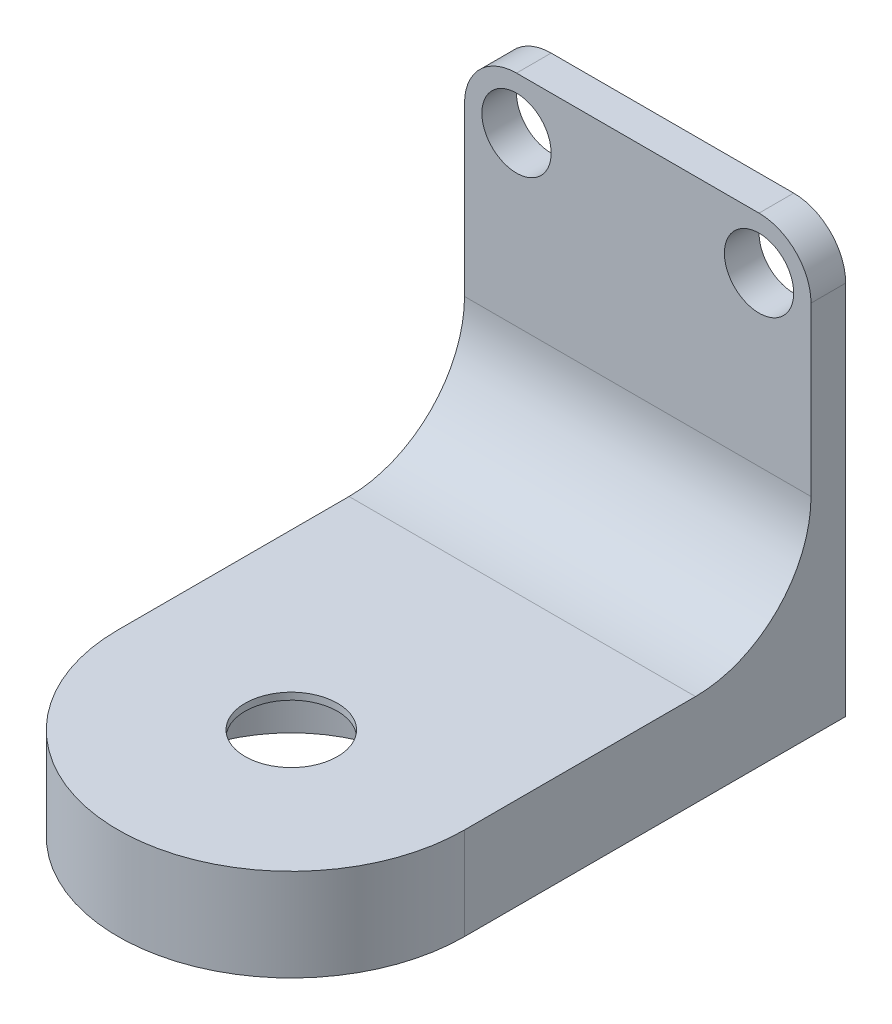
ISO-10303-21;
HEADER;
FILE_DESCRIPTION(('STEP AP214'),'2;1');
FILE_NAME('part.step','',(''),(''),'','','');
FILE_SCHEMA(('AUTOMOTIVE_DESIGN { 1 0 10303 214 1 1 1 1 }'));
ENDSEC;
DATA;
#1=APPLICATION_CONTEXT('core data for automotive mechanical design processes');
#2=APPLICATION_PROTOCOL_DEFINITION('international standard','automotive_design',2000,#1);
#3=PRODUCT_CONTEXT('',#1,'mechanical');
#4=PRODUCT('Part','Part','',(#3));
#5=PRODUCT_RELATED_PRODUCT_CATEGORY('part','',(#4));
#6=PRODUCT_DEFINITION_FORMATION('','',#4);
#7=PRODUCT_DEFINITION_CONTEXT('part definition',#1,'design');
#8=PRODUCT_DEFINITION('design','',#6,#7);
#9=PRODUCT_DEFINITION_SHAPE('','',#8);
#10=(LENGTH_UNIT() NAMED_UNIT(*) SI_UNIT(.MILLI.,.METRE.));
#11=(NAMED_UNIT(*) PLANE_ANGLE_UNIT() SI_UNIT($,.RADIAN.));
#12=(NAMED_UNIT(*) SI_UNIT($,.STERADIAN.) SOLID_ANGLE_UNIT());
#13=UNCERTAINTY_MEASURE_WITH_UNIT(LENGTH_MEASURE(1.E-05),#10,'distance_accuracy_value','');
#14=(GEOMETRIC_REPRESENTATION_CONTEXT(3) GLOBAL_UNCERTAINTY_ASSIGNED_CONTEXT((#13)) GLOBAL_UNIT_ASSIGNED_CONTEXT((#10,
#11,#12)) REPRESENTATION_CONTEXT('',''));
#15=CARTESIAN_POINT('',(0.,0.,0.));
#16=DIRECTION('',(0.,0.,1.));
#17=DIRECTION('',(1.,0.,0.));
#18=AXIS2_PLACEMENT_3D('',#15,#16,#17);
#19=CARTESIAN_POINT('',(0.,37.,0.));
#20=DIRECTION('',(0.,-1.,0.));
#21=DIRECTION('',(0.,0.,-1.));
#22=AXIS2_PLACEMENT_3D('',#19,#20,#21);
#23=CYLINDRICAL_SURFACE('',#22,4.);
#24=CARTESIAN_POINT('',(0.,8.,0.));
#25=DIRECTION('',(0.,1.,0.));
#26=DIRECTION('',(0.,0.,1.));
#27=AXIS2_PLACEMENT_3D('',#24,#25,#26);
#28=CIRCLE('',#27,4.);
#29=CARTESIAN_POINT('',(0.,8.,4.));
#30=VERTEX_POINT('',#29);
#31=EDGE_CURVE('E446',#30,#30,#28,.T.);
#32=ORIENTED_EDGE('',*,*,#31,.T.);
#33=EDGE_LOOP('',(#32));
#34=FACE_BOUND('',#33,.T.);
#35=CARTESIAN_POINT('',(0.,7.4,0.));
#36=DIRECTION('',(0.,-1.,0.));
#37=DIRECTION('',(0.,0.,-1.));
#38=AXIS2_PLACEMENT_3D('',#35,#36,#37);
#39=CIRCLE('',#38,4.);
#40=CARTESIAN_POINT('',(0.,7.4,-4.));
#41=VERTEX_POINT('',#40);
#42=EDGE_CURVE('E41',#41,#41,#39,.F.);
#43=ORIENTED_EDGE('',*,*,#42,.F.);
#44=EDGE_LOOP('',(#43));
#45=FACE_BOUND('',#44,.T.);
#46=ADVANCED_FACE('F37',(#34,#45),#23,.F.);
#47=CARTESIAN_POINT('',(0.,8.,0.));
#48=DIRECTION('',(0.,-1.,0.));
#49=DIRECTION('',(0.,0.,-1.));
#50=AXIS2_PLACEMENT_3D('',#47,#48,#49);
#51=CYLINDRICAL_SURFACE('',#50,11.);
#52=CARTESIAN_POINT('',(0.,0.,0.));
#53=DIRECTION('',(0.,1.,0.));
#54=DIRECTION('',(0.,0.,1.));
#55=AXIS2_PLACEMENT_3D('',#52,#53,#54);
#56=CIRCLE('',#55,11.);
#57=CARTESIAN_POINT('',(0.,0.,11.));
#58=VERTEX_POINT('',#57);
#59=EDGE_CURVE('E194',#58,#58,#56,.T.);
#60=ORIENTED_EDGE('',*,*,#59,.F.);
#61=EDGE_LOOP('',(#60));
#62=FACE_BOUND('',#61,.T.);
#63=CARTESIAN_POINT('',(0.,7.,0.));
#64=DIRECTION('',(0.,1.,0.));
#65=DIRECTION('',(0.,0.,1.));
#66=AXIS2_PLACEMENT_3D('',#63,#64,#65);
#67=CIRCLE('',#66,11.);
#68=CARTESIAN_POINT('',(0.,7.,11.));
#69=VERTEX_POINT('',#68);
#70=EDGE_CURVE('E142',#69,#69,#67,.T.);
#71=ORIENTED_EDGE('',*,*,#70,.T.);
#72=EDGE_LOOP('',(#71));
#73=FACE_BOUND('',#72,.T.);
#74=ADVANCED_FACE('F232',(#62,#73),#51,.F.);
#75=CARTESIAN_POINT('',(0.,8.,0.));
#76=DIRECTION('',(0.,1.,0.));
#77=DIRECTION('',(0.,0.,1.));
#78=AXIS2_PLACEMENT_3D('',#75,#76,#77);
#79=PLANE('',#78);
#80=ORIENTED_EDGE('',*,*,#31,.F.);
#81=EDGE_LOOP('',(#80));
#82=FACE_BOUND('',#81,.T.);
#83=DIRECTION('',(0.,0.,-1.));
#84=VECTOR('',#83,1.);
#85=CARTESIAN_POINT('',(15.,8.,-30.));
#86=LINE('',#85,#84);
#87=CARTESIAN_POINT('',(15.,8.,0.));
#88=VERTEX_POINT('',#87);
#89=CARTESIAN_POINT('',(15.,8.,-20.));
#90=VERTEX_POINT('',#89);
#91=EDGE_CURVE('E200',#88,#90,#86,.T.);
#92=ORIENTED_EDGE('',*,*,#91,.T.);
#93=DIRECTION('',(-1.,0.,0.));
#94=VECTOR('',#93,1.);
#95=CARTESIAN_POINT('',(0.,8.,-20.));
#96=LINE('',#95,#94);
#97=CARTESIAN_POINT('',(-15.,8.,-20.));
#98=VERTEX_POINT('',#97);
#99=EDGE_CURVE('E183',#90,#98,#96,.T.);
#100=ORIENTED_EDGE('',*,*,#99,.T.);
#101=DIRECTION('',(0.,0.,1.));
#102=VECTOR('',#101,1.);
#103=CARTESIAN_POINT('',(-15.,8.,0.));
#104=LINE('',#103,#102);
#105=CARTESIAN_POINT('',(-15.,8.,0.));
#106=VERTEX_POINT('',#105);
#107=EDGE_CURVE('E203',#98,#106,#104,.T.);
#108=ORIENTED_EDGE('',*,*,#107,.T.);
#109=CARTESIAN_POINT('',(0.,8.,0.));
#110=DIRECTION('',(0.,1.,0.));
#111=DIRECTION('',(0.,0.,1.));
#112=AXIS2_PLACEMENT_3D('',#109,#110,#111);
#113=CIRCLE('',#112,15.);
#114=EDGE_CURVE('E197',#106,#88,#113,.T.);
#115=ORIENTED_EDGE('',*,*,#114,.T.);
#116=EDGE_LOOP('',(#92,#100,#108,#115));
#117=FACE_BOUND('',#116,.T.);
#118=ADVANCED_FACE('F216',(#82,#117),#79,.T.);
#119=CARTESIAN_POINT('',(0.,0.,0.));
#120=DIRECTION('',(0.,1.,0.));
#121=DIRECTION('',(0.,0.,1.));
#122=AXIS2_PLACEMENT_3D('',#119,#120,#121);
#123=PLANE('',#122);
#124=CARTESIAN_POINT('',(0.,0.,0.));
#125=DIRECTION('',(0.,1.,0.));
#126=DIRECTION('',(0.,0.,1.));
#127=AXIS2_PLACEMENT_3D('',#124,#125,#126);
#128=CIRCLE('',#127,15.);
#129=CARTESIAN_POINT('',(-15.,0.,0.));
#130=VERTEX_POINT('',#129);
#131=CARTESIAN_POINT('',(15.,0.,0.));
#132=VERTEX_POINT('',#131);
#133=EDGE_CURVE('E120',#130,#132,#128,.T.);
#134=ORIENTED_EDGE('',*,*,#133,.F.);
#135=DIRECTION('',(0.,0.,1.));
#136=VECTOR('',#135,1.);
#137=CARTESIAN_POINT('',(-15.,0.,0.));
#138=LINE('',#137,#136);
#139=CARTESIAN_POINT('',(-15.,0.,-33.));
#140=VERTEX_POINT('',#139);
#141=EDGE_CURVE('E119',#140,#130,#138,.T.);
#142=ORIENTED_EDGE('',*,*,#141,.F.);
#143=DIRECTION('',(-1.,0.,0.));
#144=VECTOR('',#143,1.);
#145=CARTESIAN_POINT('',(0.,0.,-33.));
#146=LINE('',#145,#144);
#147=CARTESIAN_POINT('',(15.,0.,-33.));
#148=VERTEX_POINT('',#147);
#149=EDGE_CURVE('E123',#148,#140,#146,.T.);
#150=ORIENTED_EDGE('',*,*,#149,.F.);
#151=DIRECTION('',(0.,0.,-1.));
#152=VECTOR('',#151,1.);
#153=CARTESIAN_POINT('',(15.,0.,-30.));
#154=LINE('',#153,#152);
#155=EDGE_CURVE('E108',#132,#148,#154,.T.);
#156=ORIENTED_EDGE('',*,*,#155,.F.);
#157=EDGE_LOOP('',(#134,#142,#150,#156));
#158=FACE_BOUND('',#157,.T.);
#159=ORIENTED_EDGE('',*,*,#59,.T.);
#160=EDGE_LOOP('',(#159));
#161=FACE_BOUND('',#160,.T.);
#162=ADVANCED_FACE('F124',(#158,#161),#123,.F.);
#163=CARTESIAN_POINT('',(0.,8.,0.));
#164=DIRECTION('',(0.,-1.,0.));
#165=DIRECTION('',(0.,0.,-1.));
#166=AXIS2_PLACEMENT_3D('',#163,#164,#165);
#167=CYLINDRICAL_SURFACE('',#166,15.);
#168=ORIENTED_EDGE('',*,*,#133,.T.);
#169=DIRECTION('',(0.,-1.,0.));
#170=VECTOR('',#169,1.);
#171=CARTESIAN_POINT('',(15.,8.,0.));
#172=LINE('',#171,#170);
#173=EDGE_CURVE('E115',#88,#132,#172,.T.);
#174=ORIENTED_EDGE('',*,*,#173,.F.);
#175=ORIENTED_EDGE('',*,*,#114,.F.);
#176=DIRECTION('',(0.,-1.,0.));
#177=VECTOR('',#176,1.);
#178=CARTESIAN_POINT('',(-15.,8.,0.));
#179=LINE('',#178,#177);
#180=EDGE_CURVE('E205',#106,#130,#179,.T.);
#181=ORIENTED_EDGE('',*,*,#180,.T.);
#182=EDGE_LOOP('',(#168,#174,#175,#181));
#183=FACE_BOUND('',#182,.T.);
#184=ADVANCED_FACE('F223',(#183),#167,.T.);
#185=CARTESIAN_POINT('',(15.,8.,-30.));
#186=DIRECTION('',(-1.,0.,0.));
#187=DIRECTION('',(0.,0.,1.));
#188=AXIS2_PLACEMENT_3D('',#185,#186,#187);
#189=PLANE('',#188);
#190=ORIENTED_EDGE('',*,*,#155,.T.);
#191=DIRECTION('',(0.,-1.,0.));
#192=VECTOR('',#191,1.);
#193=CARTESIAN_POINT('',(15.,0.,-33.));
#194=LINE('',#193,#192);
#195=CARTESIAN_POINT('',(15.,32.5,-33.));
#196=VERTEX_POINT('',#195);
#197=EDGE_CURVE('E113',#196,#148,#194,.T.);
#198=ORIENTED_EDGE('',*,*,#197,.F.);
#199=DIRECTION('',(0.,0.,1.));
#200=VECTOR('',#199,1.);
#201=CARTESIAN_POINT('',(15.,32.5,-33.));
#202=LINE('',#201,#200);
#203=CARTESIAN_POINT('',(15.,32.5,-30.));
#204=VERTEX_POINT('',#203);
#205=EDGE_CURVE('E164',#196,#204,#202,.T.);
#206=ORIENTED_EDGE('',*,*,#205,.T.);
#207=DIRECTION('',(0.,-1.,0.));
#208=VECTOR('',#207,1.);
#209=CARTESIAN_POINT('',(15.,0.,-30.));
#210=LINE('',#209,#208);
#211=CARTESIAN_POINT('',(15.,18.,-30.));
#212=VERTEX_POINT('',#211);
#213=EDGE_CURVE('E165',#204,#212,#210,.T.);
#214=ORIENTED_EDGE('',*,*,#213,.T.);
#215=CARTESIAN_POINT('',(15.,18.,-20.));
#216=DIRECTION('',(-1.,0.,0.));
#217=DIRECTION('',(0.,0.,1.));
#218=AXIS2_PLACEMENT_3D('',#215,#216,#217);
#219=CIRCLE('',#218,10.);
#220=EDGE_CURVE('E11',#212,#90,#219,.T.);
#221=ORIENTED_EDGE('',*,*,#220,.T.);
#222=ORIENTED_EDGE('',*,*,#91,.F.);
#223=ORIENTED_EDGE('',*,*,#173,.T.);
#224=EDGE_LOOP('',(#190,#198,#206,#214,#221,#222,#223));
#225=FACE_BOUND('',#224,.T.);
#226=ADVANCED_FACE('F110',(#225),#189,.F.);
#227=CARTESIAN_POINT('',(-15.,8.,0.));
#228=DIRECTION('',(1.,0.,0.));
#229=DIRECTION('',(0.,0.,-1.));
#230=AXIS2_PLACEMENT_3D('',#227,#228,#229);
#231=PLANE('',#230);
#232=ORIENTED_EDGE('',*,*,#141,.T.);
#233=ORIENTED_EDGE('',*,*,#180,.F.);
#234=ORIENTED_EDGE('',*,*,#107,.F.);
#235=CARTESIAN_POINT('',(-15.,18.,-20.));
#236=DIRECTION('',(1.,0.,0.));
#237=DIRECTION('',(0.,0.,-1.));
#238=AXIS2_PLACEMENT_3D('',#235,#236,#237);
#239=CIRCLE('',#238,10.);
#240=CARTESIAN_POINT('',(-15.,18.,-30.));
#241=VERTEX_POINT('',#240);
#242=EDGE_CURVE('E46',#98,#241,#239,.T.);
#243=ORIENTED_EDGE('',*,*,#242,.T.);
#244=DIRECTION('',(0.,1.,0.));
#245=VECTOR('',#244,1.);
#246=CARTESIAN_POINT('',(-15.,0.,-30.));
#247=LINE('',#246,#245);
#248=CARTESIAN_POINT('',(-15.,32.5,-30.));
#249=VERTEX_POINT('',#248);
#250=EDGE_CURVE('E167',#241,#249,#247,.T.);
#251=ORIENTED_EDGE('',*,*,#250,.T.);
#252=DIRECTION('',(0.,0.,1.));
#253=VECTOR('',#252,1.);
#254=CARTESIAN_POINT('',(-15.,32.5,-33.));
#255=LINE('',#254,#253);
#256=CARTESIAN_POINT('',(-15.,32.5,-33.));
#257=VERTEX_POINT('',#256);
#258=EDGE_CURVE('E191',#257,#249,#255,.T.);
#259=ORIENTED_EDGE('',*,*,#258,.F.);
#260=DIRECTION('',(0.,1.,0.));
#261=VECTOR('',#260,1.);
#262=CARTESIAN_POINT('',(-15.,0.,-33.));
#263=LINE('',#262,#261);
#264=EDGE_CURVE('E128',#140,#257,#263,.T.);
#265=ORIENTED_EDGE('',*,*,#264,.F.);
#266=EDGE_LOOP('',(#232,#233,#234,#243,#251,#259,#265));
#267=FACE_BOUND('',#266,.T.);
#268=ADVANCED_FACE('F220',(#267),#231,.F.);
#269=CARTESIAN_POINT('',(-10.5,32.5,-33.));
#270=DIRECTION('',(0.,0.,1.));
#271=DIRECTION('',(1.,0.,0.));
#272=AXIS2_PLACEMENT_3D('',#269,#270,#271);
#273=CYLINDRICAL_SURFACE('',#272,4.5);
#274=CARTESIAN_POINT('',(-10.5,32.5,-30.));
#275=DIRECTION('',(0.,0.,-1.));
#276=DIRECTION('',(-1.,0.,0.));
#277=AXIS2_PLACEMENT_3D('',#274,#275,#276);
#278=CIRCLE('',#277,4.5);
#279=CARTESIAN_POINT('',(-10.5,37.,-30.));
#280=VERTEX_POINT('',#279);
#281=EDGE_CURVE('E169',#249,#280,#278,.T.);
#282=ORIENTED_EDGE('',*,*,#281,.T.);
#283=DIRECTION('',(0.,0.,1.));
#284=VECTOR('',#283,1.);
#285=CARTESIAN_POINT('',(-10.5,37.,-33.));
#286=LINE('',#285,#284);
#287=CARTESIAN_POINT('',(-10.5,37.,-33.));
#288=VERTEX_POINT('',#287);
#289=EDGE_CURVE('E189',#288,#280,#286,.T.);
#290=ORIENTED_EDGE('',*,*,#289,.F.);
#291=CARTESIAN_POINT('',(-10.5,32.5,-33.));
#292=DIRECTION('',(0.,0.,-1.));
#293=DIRECTION('',(-1.,0.,0.));
#294=AXIS2_PLACEMENT_3D('',#291,#292,#293);
#295=CIRCLE('',#294,4.5);
#296=EDGE_CURVE('E146',#257,#288,#295,.T.);
#297=ORIENTED_EDGE('',*,*,#296,.F.);
#298=ORIENTED_EDGE('',*,*,#258,.T.);
#299=EDGE_LOOP('',(#282,#290,#297,#298));
#300=FACE_BOUND('',#299,.T.);
#301=ADVANCED_FACE('F280',(#300),#273,.T.);
#302=CARTESIAN_POINT('',(0.,37.,-33.));
#303=DIRECTION('',(0.,1.,0.));
#304=DIRECTION('',(0.,0.,1.));
#305=AXIS2_PLACEMENT_3D('',#302,#303,#304);
#306=PLANE('',#305);
#307=DIRECTION('',(-1.,0.,0.));
#308=VECTOR('',#307,1.);
#309=CARTESIAN_POINT('',(0.,37.,-30.));
#310=LINE('',#309,#308);
#311=CARTESIAN_POINT('',(10.5,37.,-30.));
#312=VERTEX_POINT('',#311);
#313=EDGE_CURVE('E172',#312,#280,#310,.T.);
#314=ORIENTED_EDGE('',*,*,#313,.F.);
#315=DIRECTION('',(0.,0.,1.));
#316=VECTOR('',#315,1.);
#317=CARTESIAN_POINT('',(10.5,37.,-33.));
#318=LINE('',#317,#316);
#319=CARTESIAN_POINT('',(10.5,37.,-33.));
#320=VERTEX_POINT('',#319);
#321=EDGE_CURVE('E187',#320,#312,#318,.T.);
#322=ORIENTED_EDGE('',*,*,#321,.F.);
#323=DIRECTION('',(-1.,0.,0.));
#324=VECTOR('',#323,1.);
#325=CARTESIAN_POINT('',(0.,37.,-33.));
#326=LINE('',#325,#324);
#327=EDGE_CURVE('E148',#320,#288,#326,.T.);
#328=ORIENTED_EDGE('',*,*,#327,.T.);
#329=ORIENTED_EDGE('',*,*,#289,.T.);
#330=EDGE_LOOP('',(#314,#322,#328,#329));
#331=FACE_BOUND('',#330,.T.);
#332=ADVANCED_FACE('F266',(#331),#306,.T.);
#333=CARTESIAN_POINT('',(-10.5,32.5,-33.));
#334=DIRECTION('',(0.,0.,1.));
#335=DIRECTION('',(1.,0.,0.));
#336=AXIS2_PLACEMENT_3D('',#333,#334,#335);
#337=CYLINDRICAL_SURFACE('',#336,3.);
#338=CARTESIAN_POINT('',(-10.5,32.5,-33.));
#339=DIRECTION('',(0.,0.,-1.));
#340=DIRECTION('',(-1.,0.,0.));
#341=AXIS2_PLACEMENT_3D('',#338,#339,#340);
#342=CIRCLE('',#341,3.);
#343=CARTESIAN_POINT('',(-13.5,32.5,-33.));
#344=VERTEX_POINT('',#343);
#345=EDGE_CURVE('E158',#344,#344,#342,.F.);
#346=ORIENTED_EDGE('',*,*,#345,.F.);
#347=EDGE_LOOP('',(#346));
#348=FACE_BOUND('',#347,.T.);
#349=CARTESIAN_POINT('',(-10.5,32.5,-30.));
#350=DIRECTION('',(0.,0.,-1.));
#351=DIRECTION('',(-1.,0.,0.));
#352=AXIS2_PLACEMENT_3D('',#349,#350,#351);
#353=CIRCLE('',#352,3.);
#354=CARTESIAN_POINT('',(-13.5,32.5,-30.));
#355=VERTEX_POINT('',#354);
#356=EDGE_CURVE('E139',#355,#355,#353,.F.);
#357=ORIENTED_EDGE('',*,*,#356,.T.);
#358=EDGE_LOOP('',(#357));
#359=FACE_BOUND('',#358,.T.);
#360=ADVANCED_FACE('F262',(#348,#359),#337,.F.);
#361=CARTESIAN_POINT('',(-10.5,4.,-33.));
#362=DIRECTION('',(0.,0.,1.));
#363=DIRECTION('',(1.,0.,0.));
#364=AXIS2_PLACEMENT_3D('',#361,#362,#363);
#365=CYLINDRICAL_SURFACE('',#364,3.);
#366=CARTESIAN_POINT('',(-10.5,4.,-33.));
#367=DIRECTION('',(0.,0.,-1.));
#368=DIRECTION('',(-1.,0.,0.));
#369=AXIS2_PLACEMENT_3D('',#366,#367,#368);
#370=CIRCLE('',#369,3.);
#371=CARTESIAN_POINT('',(-13.5,4.,-33.));
#372=VERTEX_POINT('',#371);
#373=EDGE_CURVE('E155',#372,#372,#370,.F.);
#374=ORIENTED_EDGE('',*,*,#373,.F.);
#375=EDGE_LOOP('',(#374));
#376=FACE_BOUND('',#375,.T.);
#377=CARTESIAN_POINT('',(-10.5,4.,-30.));
#378=DIRECTION('',(0.,0.,-1.));
#379=DIRECTION('',(-1.,0.,0.));
#380=AXIS2_PLACEMENT_3D('',#377,#378,#379);
#381=CIRCLE('',#380,3.);
#382=CARTESIAN_POINT('',(-13.5,4.,-30.));
#383=VERTEX_POINT('',#382);
#384=EDGE_CURVE('E180',#383,#383,#381,.F.);
#385=ORIENTED_EDGE('',*,*,#384,.T.);
#386=EDGE_LOOP('',(#385));
#387=FACE_BOUND('',#386,.T.);
#388=ADVANCED_FACE('F265',(#376,#387),#365,.F.);
#389=CARTESIAN_POINT('',(10.5,4.,-33.));
#390=DIRECTION('',(0.,0.,1.));
#391=DIRECTION('',(1.,0.,0.));
#392=AXIS2_PLACEMENT_3D('',#389,#390,#391);
#393=CYLINDRICAL_SURFACE('',#392,3.);
#394=CARTESIAN_POINT('',(10.5,4.,-33.));
#395=DIRECTION('',(0.,0.,-1.));
#396=DIRECTION('',(-1.,0.,0.));
#397=AXIS2_PLACEMENT_3D('',#394,#395,#396);
#398=CIRCLE('',#397,3.);
#399=CARTESIAN_POINT('',(7.5,4.,-33.));
#400=VERTEX_POINT('',#399);
#401=EDGE_CURVE('E152',#400,#400,#398,.T.);
#402=ORIENTED_EDGE('',*,*,#401,.T.);
#403=EDGE_LOOP('',(#402));
#404=FACE_BOUND('',#403,.T.);
#405=CARTESIAN_POINT('',(10.5,4.,-30.));
#406=DIRECTION('',(0.,0.,-1.));
#407=DIRECTION('',(-1.,0.,0.));
#408=AXIS2_PLACEMENT_3D('',#405,#406,#407);
#409=CIRCLE('',#408,3.);
#410=CARTESIAN_POINT('',(7.5,4.,-30.));
#411=VERTEX_POINT('',#410);
#412=EDGE_CURVE('E177',#411,#411,#409,.T.);
#413=ORIENTED_EDGE('',*,*,#412,.F.);
#414=EDGE_LOOP('',(#413));
#415=FACE_BOUND('',#414,.T.);
#416=ADVANCED_FACE('F270',(#404,#415),#393,.F.);
#417=CARTESIAN_POINT('',(10.5,32.5,-33.));
#418=DIRECTION('',(0.,0.,1.));
#419=DIRECTION('',(1.,0.,0.));
#420=AXIS2_PLACEMENT_3D('',#417,#418,#419);
#421=CYLINDRICAL_SURFACE('',#420,4.5);
#422=CARTESIAN_POINT('',(10.5,32.5,-30.));
#423=DIRECTION('',(0.,0.,-1.));
#424=DIRECTION('',(-1.,0.,0.));
#425=AXIS2_PLACEMENT_3D('',#422,#423,#424);
#426=CIRCLE('',#425,4.5);
#427=EDGE_CURVE('E175',#312,#204,#426,.T.);
#428=ORIENTED_EDGE('',*,*,#427,.T.);
#429=ORIENTED_EDGE('',*,*,#205,.F.);
#430=CARTESIAN_POINT('',(10.5,32.5,-33.));
#431=DIRECTION('',(0.,0.,-1.));
#432=DIRECTION('',(-1.,0.,0.));
#433=AXIS2_PLACEMENT_3D('',#430,#431,#432);
#434=CIRCLE('',#433,4.5);
#435=EDGE_CURVE('E134',#320,#196,#434,.T.);
#436=ORIENTED_EDGE('',*,*,#435,.F.);
#437=ORIENTED_EDGE('',*,*,#321,.T.);
#438=EDGE_LOOP('',(#428,#429,#436,#437));
#439=FACE_BOUND('',#438,.T.);
#440=ADVANCED_FACE('F260',(#439),#421,.T.);
#441=CARTESIAN_POINT('',(10.5,32.5,-33.));
#442=DIRECTION('',(0.,0.,1.));
#443=DIRECTION('',(1.,0.,0.));
#444=AXIS2_PLACEMENT_3D('',#441,#442,#443);
#445=CYLINDRICAL_SURFACE('',#444,3.);
#446=CARTESIAN_POINT('',(10.5,32.5,-33.));
#447=DIRECTION('',(0.,0.,-1.));
#448=DIRECTION('',(-1.,0.,0.));
#449=AXIS2_PLACEMENT_3D('',#446,#447,#448);
#450=CIRCLE('',#449,3.);
#451=CARTESIAN_POINT('',(7.5,32.5,-33.));
#452=VERTEX_POINT('',#451);
#453=EDGE_CURVE('E161',#452,#452,#450,.T.);
#454=ORIENTED_EDGE('',*,*,#453,.T.);
#455=EDGE_LOOP('',(#454));
#456=FACE_BOUND('',#455,.T.);
#457=CARTESIAN_POINT('',(10.5,32.5,-30.));
#458=DIRECTION('',(0.,0.,-1.));
#459=DIRECTION('',(-1.,0.,0.));
#460=AXIS2_PLACEMENT_3D('',#457,#458,#459);
#461=CIRCLE('',#460,3.);
#462=CARTESIAN_POINT('',(7.5,32.5,-30.));
#463=VERTEX_POINT('',#462);
#464=EDGE_CURVE('E136',#463,#463,#461,.T.);
#465=ORIENTED_EDGE('',*,*,#464,.F.);
#466=EDGE_LOOP('',(#465));
#467=FACE_BOUND('',#466,.T.);
#468=ADVANCED_FACE('F254',(#456,#467),#445,.F.);
#469=CARTESIAN_POINT('',(0.,0.,-33.));
#470=DIRECTION('',(0.,0.,-1.));
#471=DIRECTION('',(-1.,0.,0.));
#472=AXIS2_PLACEMENT_3D('',#469,#470,#471);
#473=PLANE('',#472);
#474=ORIENTED_EDGE('',*,*,#197,.T.);
#475=ORIENTED_EDGE('',*,*,#149,.T.);
#476=ORIENTED_EDGE('',*,*,#264,.T.);
#477=ORIENTED_EDGE('',*,*,#296,.T.);
#478=ORIENTED_EDGE('',*,*,#327,.F.);
#479=ORIENTED_EDGE('',*,*,#435,.T.);
#480=EDGE_LOOP('',(#474,#475,#476,#477,#478,#479));
#481=FACE_BOUND('',#480,.T.);
#482=ORIENTED_EDGE('',*,*,#401,.F.);
#483=EDGE_LOOP('',(#482));
#484=FACE_BOUND('',#483,.T.);
#485=ORIENTED_EDGE('',*,*,#373,.T.);
#486=EDGE_LOOP('',(#485));
#487=FACE_BOUND('',#486,.T.);
#488=ORIENTED_EDGE('',*,*,#345,.T.);
#489=EDGE_LOOP('',(#488));
#490=FACE_BOUND('',#489,.T.);
#491=ORIENTED_EDGE('',*,*,#453,.F.);
#492=EDGE_LOOP('',(#491));
#493=FACE_BOUND('',#492,.T.);
#494=ADVANCED_FACE('F130',(#481,#484,#487,#490,#493),#473,.T.);
#495=CARTESIAN_POINT('',(0.,0.,-30.));
#496=DIRECTION('',(0.,0.,-1.));
#497=DIRECTION('',(-1.,0.,0.));
#498=AXIS2_PLACEMENT_3D('',#495,#496,#497);
#499=PLANE('',#498);
#500=ORIENTED_EDGE('',*,*,#250,.F.);
#501=DIRECTION('',(-1.,0.,0.));
#502=VECTOR('',#501,1.);
#503=CARTESIAN_POINT('',(0.,18.,-30.));
#504=LINE('',#503,#502);
#505=EDGE_CURVE('E59',#241,#212,#504,.F.);
#506=ORIENTED_EDGE('',*,*,#505,.T.);
#507=ORIENTED_EDGE('',*,*,#213,.F.);
#508=ORIENTED_EDGE('',*,*,#427,.F.);
#509=ORIENTED_EDGE('',*,*,#313,.T.);
#510=ORIENTED_EDGE('',*,*,#281,.F.);
#511=EDGE_LOOP('',(#500,#506,#507,#508,#509,#510));
#512=FACE_BOUND('',#511,.T.);
#513=ORIENTED_EDGE('',*,*,#356,.F.);
#514=EDGE_LOOP('',(#513));
#515=FACE_BOUND('',#514,.T.);
#516=ORIENTED_EDGE('',*,*,#464,.T.);
#517=EDGE_LOOP('',(#516));
#518=FACE_BOUND('',#517,.T.);
#519=ADVANCED_FACE('F253',(#512,#515,#518),#499,.F.);
#520=CARTESIAN_POINT('',(-15.,8.,-30.));
#521=DIRECTION('',(0.,0.,1.));
#522=DIRECTION('',(1.,0.,0.));
#523=AXIS2_PLACEMENT_3D('',#520,#521,#522);
#524=PLANE('',#523);
#525=ORIENTED_EDGE('',*,*,#384,.F.);
#526=EDGE_LOOP('',(#525));
#527=FACE_BOUND('',#526,.T.);
#528=ADVANCED_FACE('F257',(#527),#524,.F.);
#529=ORIENTED_EDGE('',*,*,#412,.T.);
#530=EDGE_LOOP('',(#529));
#531=FACE_BOUND('',#530,.T.);
#532=ADVANCED_FACE('F290',(#531),#524,.F.);
#533=CARTESIAN_POINT('',(0.,18.,-20.));
#534=DIRECTION('',(-1.,0.,0.));
#535=DIRECTION('',(0.,0.,1.));
#536=AXIS2_PLACEMENT_3D('',#533,#534,#535);
#537=CYLINDRICAL_SURFACE('',#536,10.);
#538=ORIENTED_EDGE('',*,*,#220,.F.);
#539=ORIENTED_EDGE('',*,*,#505,.F.);
#540=ORIENTED_EDGE('',*,*,#242,.F.);
#541=ORIENTED_EDGE('',*,*,#99,.F.);
#542=EDGE_LOOP('',(#538,#539,#540,#541));
#543=FACE_BOUND('',#542,.T.);
#544=ADVANCED_FACE('F39',(#543),#537,.F.);
#545=CARTESIAN_POINT('',(0.,7.,0.));
#546=DIRECTION('',(0.,1.,0.));
#547=DIRECTION('',(0.,0.,1.));
#548=AXIS2_PLACEMENT_3D('',#545,#546,#547);
#549=PLANE('',#548);
#550=CARTESIAN_POINT('',(0.,7.,0.));
#551=DIRECTION('',(0.,-1.,0.));
#552=DIRECTION('',(0.,0.,-1.));
#553=AXIS2_PLACEMENT_3D('',#550,#551,#552);
#554=CIRCLE('',#553,6.25);
#555=CARTESIAN_POINT('',(0.,7.,-6.25));
#556=VERTEX_POINT('',#555);
#557=EDGE_CURVE('E443',#556,#556,#554,.T.);
#558=ORIENTED_EDGE('',*,*,#557,.F.);
#559=EDGE_LOOP('',(#558));
#560=FACE_BOUND('',#559,.T.);
#561=ORIENTED_EDGE('',*,*,#70,.F.);
#562=EDGE_LOOP('',(#561));
#563=FACE_BOUND('',#562,.T.);
#564=ADVANCED_FACE('F246',(#560,#563),#549,.F.);
#565=CARTESIAN_POINT('',(0.,7.4,0.));
#566=DIRECTION('',(0.,-1.,0.));
#567=DIRECTION('',(0.,0.,-1.));
#568=AXIS2_PLACEMENT_3D('',#565,#566,#567);
#569=PLANE('',#568);
#570=CARTESIAN_POINT('',(0.,7.4,0.));
#571=DIRECTION('',(0.,-1.,0.));
#572=DIRECTION('',(0.,0.,-1.));
#573=AXIS2_PLACEMENT_3D('',#570,#571,#572);
#574=CIRCLE('',#573,6.25);
#575=CARTESIAN_POINT('',(0.,7.4,-6.25));
#576=VERTEX_POINT('',#575);
#577=EDGE_CURVE('E440',#576,#576,#574,.T.);
#578=ORIENTED_EDGE('',*,*,#577,.T.);
#579=EDGE_LOOP('',(#578));
#580=FACE_BOUND('',#579,.T.);
#581=ORIENTED_EDGE('',*,*,#42,.T.);
#582=EDGE_LOOP('',(#581));
#583=FACE_BOUND('',#582,.T.);
#584=ADVANCED_FACE('F249',(#580,#583),#569,.T.);
#585=CARTESIAN_POINT('',(0.,7.4,0.));
#586=DIRECTION('',(0.,-1.,0.));
#587=DIRECTION('',(0.,0.,-1.));
#588=AXIS2_PLACEMENT_3D('',#585,#586,#587);
#589=CYLINDRICAL_SURFACE('',#588,6.25);
#590=ORIENTED_EDGE('',*,*,#577,.F.);
#591=EDGE_LOOP('',(#590));
#592=FACE_BOUND('',#591,.T.);
#593=ORIENTED_EDGE('',*,*,#557,.T.);
#594=EDGE_LOOP('',(#593));
#595=FACE_BOUND('',#594,.T.);
#596=ADVANCED_FACE('F244',(#592,#595),#589,.F.);
#597=CLOSED_SHELL('',(#46,#74,#118,#162,#184,#226,#268,#301,#332,#360,#388,#416,#440,#468,#494,
#519,#528,#532,#544,#564,#584,#596));
#598=MANIFOLD_SOLID_BREP('B2',#597);
#599=ADVANCED_BREP_SHAPE_REPRESENTATION('',(#18,#598),#14);
#600=SHAPE_DEFINITION_REPRESENTATION(#9,#599);
ENDSEC;
END-ISO-10303-21;
